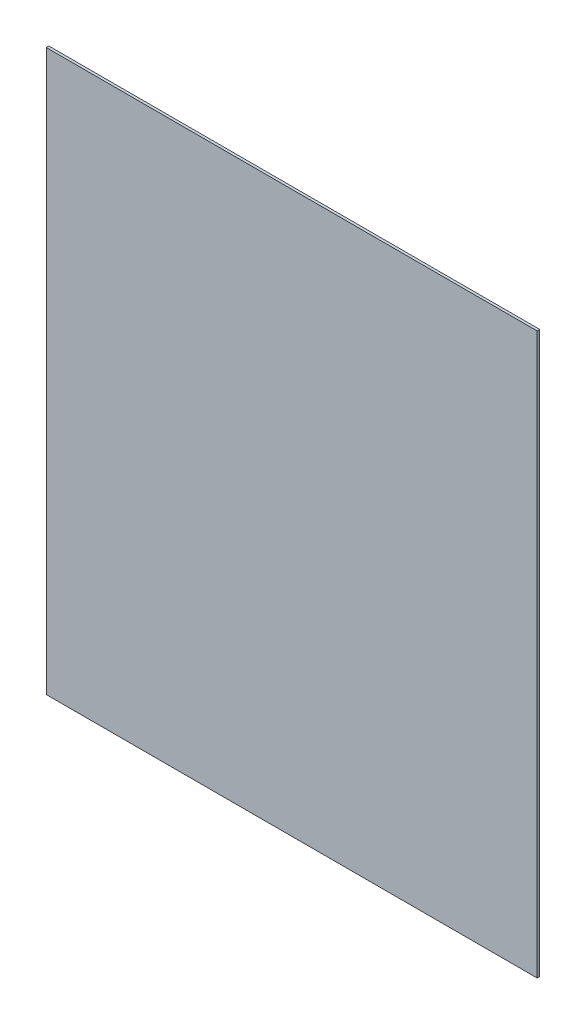
ISO-10303-21;
HEADER;
FILE_DESCRIPTION(('STEP AP214'),'2;1');
FILE_NAME('part.step','',(''),(''),'','','');
FILE_SCHEMA(('AUTOMOTIVE_DESIGN { 1 0 10303 214 1 1 1 1 }'));
ENDSEC;
DATA;
#1=APPLICATION_CONTEXT('core data for automotive mechanical design processes');
#2=APPLICATION_PROTOCOL_DEFINITION('international standard','automotive_design',2000,#1);
#3=PRODUCT_CONTEXT('',#1,'mechanical');
#4=PRODUCT('Part','Part','',(#3));
#5=PRODUCT_RELATED_PRODUCT_CATEGORY('part','',(#4));
#6=PRODUCT_DEFINITION_FORMATION('','',#4);
#7=PRODUCT_DEFINITION_CONTEXT('part definition',#1,'design');
#8=PRODUCT_DEFINITION('design','',#6,#7);
#9=PRODUCT_DEFINITION_SHAPE('','',#8);
#10=(LENGTH_UNIT() NAMED_UNIT(*) SI_UNIT(.MILLI.,.METRE.));
#11=(NAMED_UNIT(*) PLANE_ANGLE_UNIT() SI_UNIT($,.RADIAN.));
#12=(NAMED_UNIT(*) SI_UNIT($,.STERADIAN.) SOLID_ANGLE_UNIT());
#13=UNCERTAINTY_MEASURE_WITH_UNIT(LENGTH_MEASURE(1.E-05),#10,'distance_accuracy_value','');
#14=(GEOMETRIC_REPRESENTATION_CONTEXT(3) GLOBAL_UNCERTAINTY_ASSIGNED_CONTEXT((#13)) GLOBAL_UNIT_ASSIGNED_CONTEXT((#10,
#11,#12)) REPRESENTATION_CONTEXT('',''));
#15=CARTESIAN_POINT('',(0.,0.,0.));
#16=DIRECTION('',(0.,0.,1.));
#17=DIRECTION('',(1.,0.,0.));
#18=AXIS2_PLACEMENT_3D('',#15,#16,#17);
#19=CARTESIAN_POINT('',(282.5,322.5,3.));
#20=DIRECTION('',(-1.,0.,0.));
#21=DIRECTION('',(0.,-1.,0.));
#22=AXIS2_PLACEMENT_3D('',#19,#20,#21);
#23=PLANE('',#22);
#24=DIRECTION('',(0.,1.,0.));
#25=VECTOR('',#24,1.);
#26=CARTESIAN_POINT('',(282.5,322.5,0.));
#27=LINE('',#26,#25);
#28=CARTESIAN_POINT('',(282.5,-322.5,0.));
#29=VERTEX_POINT('',#28);
#30=CARTESIAN_POINT('',(282.5,322.5,0.));
#31=VERTEX_POINT('',#30);
#32=EDGE_CURVE('E96',#29,#31,#27,.T.);
#33=ORIENTED_EDGE('',*,*,#32,.T.);
#34=DIRECTION('',(0.,0.,-1.));
#35=VECTOR('',#34,1.);
#36=CARTESIAN_POINT('',(282.5,322.5,3.));
#37=LINE('',#36,#35);
#38=CARTESIAN_POINT('',(282.5,322.5,3.));
#39=VERTEX_POINT('',#38);
#40=EDGE_CURVE('E11',#39,#31,#37,.T.);
#41=ORIENTED_EDGE('',*,*,#40,.F.);
#42=DIRECTION('',(0.,1.,0.));
#43=VECTOR('',#42,1.);
#44=CARTESIAN_POINT('',(282.5,322.5,3.));
#45=LINE('',#44,#43);
#46=CARTESIAN_POINT('',(282.5,-322.5,3.));
#47=VERTEX_POINT('',#46);
#48=EDGE_CURVE('E84',#47,#39,#45,.T.);
#49=ORIENTED_EDGE('',*,*,#48,.F.);
#50=DIRECTION('',(0.,0.,-1.));
#51=VECTOR('',#50,1.);
#52=CARTESIAN_POINT('',(282.5,-322.5,3.));
#53=LINE('',#52,#51);
#54=EDGE_CURVE('E92',#47,#29,#53,.T.);
#55=ORIENTED_EDGE('',*,*,#54,.T.);
#56=EDGE_LOOP('',(#33,#41,#49,#55));
#57=FACE_BOUND('',#56,.T.);
#58=ADVANCED_FACE('F33',(#57),#23,.F.);
#59=CARTESIAN_POINT('',(-282.5,322.5,3.));
#60=DIRECTION('',(0.,-1.,0.));
#61=DIRECTION('',(0.,0.,-1.));
#62=AXIS2_PLACEMENT_3D('',#59,#60,#61);
#63=PLANE('',#62);
#64=DIRECTION('',(-1.,0.,0.));
#65=VECTOR('',#64,1.);
#66=CARTESIAN_POINT('',(-282.5,322.5,0.));
#67=LINE('',#66,#65);
#68=CARTESIAN_POINT('',(-282.5,322.5,0.));
#69=VERTEX_POINT('',#68);
#70=EDGE_CURVE('E88',#31,#69,#67,.T.);
#71=ORIENTED_EDGE('',*,*,#70,.T.);
#72=DIRECTION('',(0.,0.,-1.));
#73=VECTOR('',#72,1.);
#74=CARTESIAN_POINT('',(-282.5,322.5,3.));
#75=LINE('',#74,#73);
#76=CARTESIAN_POINT('',(-282.5,322.5,3.));
#77=VERTEX_POINT('',#76);
#78=EDGE_CURVE('E41',#77,#69,#75,.T.);
#79=ORIENTED_EDGE('',*,*,#78,.F.);
#80=DIRECTION('',(-1.,0.,0.));
#81=VECTOR('',#80,1.);
#82=CARTESIAN_POINT('',(-282.5,322.5,3.));
#83=LINE('',#82,#81);
#84=EDGE_CURVE('E79',#39,#77,#83,.T.);
#85=ORIENTED_EDGE('',*,*,#84,.F.);
#86=ORIENTED_EDGE('',*,*,#40,.T.);
#87=EDGE_LOOP('',(#71,#79,#85,#86));
#88=FACE_BOUND('',#87,.T.);
#89=ADVANCED_FACE('F87',(#88),#63,.F.);
#90=CARTESIAN_POINT('',(-282.5,322.5,3.));
#91=DIRECTION('',(1.,0.,0.));
#92=DIRECTION('',(0.,1.,0.));
#93=AXIS2_PLACEMENT_3D('',#90,#91,#92);
#94=PLANE('',#93);
#95=DIRECTION('',(0.,-1.,0.));
#96=VECTOR('',#95,1.);
#97=CARTESIAN_POINT('',(-282.5,322.5,0.));
#98=LINE('',#97,#96);
#99=CARTESIAN_POINT('',(-282.5,-322.5,0.));
#100=VERTEX_POINT('',#99);
#101=EDGE_CURVE('E66',#69,#100,#98,.T.);
#102=ORIENTED_EDGE('',*,*,#101,.T.);
#103=DIRECTION('',(0.,0.,-1.));
#104=VECTOR('',#103,1.);
#105=CARTESIAN_POINT('',(-282.5,-322.5,3.));
#106=LINE('',#105,#104);
#107=CARTESIAN_POINT('',(-282.5,-322.5,3.));
#108=VERTEX_POINT('',#107);
#109=EDGE_CURVE('E89',#108,#100,#106,.T.);
#110=ORIENTED_EDGE('',*,*,#109,.F.);
#111=DIRECTION('',(0.,-1.,0.));
#112=VECTOR('',#111,1.);
#113=CARTESIAN_POINT('',(-282.5,322.5,3.));
#114=LINE('',#113,#112);
#115=EDGE_CURVE('E82',#77,#108,#114,.T.);
#116=ORIENTED_EDGE('',*,*,#115,.F.);
#117=ORIENTED_EDGE('',*,*,#78,.T.);
#118=EDGE_LOOP('',(#102,#110,#116,#117));
#119=FACE_BOUND('',#118,.T.);
#120=ADVANCED_FACE('F90',(#119),#94,.F.);
#121=CARTESIAN_POINT('',(-282.5,-322.5,3.));
#122=DIRECTION('',(0.,1.,0.));
#123=DIRECTION('',(0.,0.,1.));
#124=AXIS2_PLACEMENT_3D('',#121,#122,#123);
#125=PLANE('',#124);
#126=DIRECTION('',(1.,0.,0.));
#127=VECTOR('',#126,1.);
#128=CARTESIAN_POINT('',(-282.5,-322.5,0.));
#129=LINE('',#128,#127);
#130=EDGE_CURVE('E72',#100,#29,#129,.T.);
#131=ORIENTED_EDGE('',*,*,#130,.T.);
#132=ORIENTED_EDGE('',*,*,#54,.F.);
#133=DIRECTION('',(1.,0.,0.));
#134=VECTOR('',#133,1.);
#135=CARTESIAN_POINT('',(-282.5,-322.5,3.));
#136=LINE('',#135,#134);
#137=EDGE_CURVE('E49',#108,#47,#136,.T.);
#138=ORIENTED_EDGE('',*,*,#137,.F.);
#139=ORIENTED_EDGE('',*,*,#109,.T.);
#140=EDGE_LOOP('',(#131,#132,#138,#139));
#141=FACE_BOUND('',#140,.T.);
#142=ADVANCED_FACE('F103',(#141),#125,.F.);
#143=CARTESIAN_POINT('',(0.,0.,3.));
#144=DIRECTION('',(0.,0.,1.));
#145=DIRECTION('',(1.,0.,0.));
#146=AXIS2_PLACEMENT_3D('',#143,#144,#145);
#147=PLANE('',#146);
#148=ORIENTED_EDGE('',*,*,#48,.T.);
#149=ORIENTED_EDGE('',*,*,#84,.T.);
#150=ORIENTED_EDGE('',*,*,#115,.T.);
#151=ORIENTED_EDGE('',*,*,#137,.T.);
#152=EDGE_LOOP('',(#148,#149,#150,#151));
#153=FACE_BOUND('',#152,.T.);
#154=ADVANCED_FACE('F80',(#153),#147,.T.);
#155=CARTESIAN_POINT('',(0.,0.,0.));
#156=DIRECTION('',(0.,0.,1.));
#157=DIRECTION('',(1.,0.,0.));
#158=AXIS2_PLACEMENT_3D('',#155,#156,#157);
#159=PLANE('',#158);
#160=ORIENTED_EDGE('',*,*,#32,.F.);
#161=ORIENTED_EDGE('',*,*,#130,.F.);
#162=ORIENTED_EDGE('',*,*,#101,.F.);
#163=ORIENTED_EDGE('',*,*,#70,.F.);
#164=EDGE_LOOP('',(#160,#161,#162,#163));
#165=FACE_BOUND('',#164,.T.);
#166=ADVANCED_FACE('F106',(#165),#159,.F.);
#167=CLOSED_SHELL('',(#58,#89,#120,#142,#154,#166));
#168=MANIFOLD_SOLID_BREP('B2',#167);
#169=ADVANCED_BREP_SHAPE_REPRESENTATION('',(#18,#168),#14);
#170=SHAPE_DEFINITION_REPRESENTATION(#9,#169);
ENDSEC;
END-ISO-10303-21;
